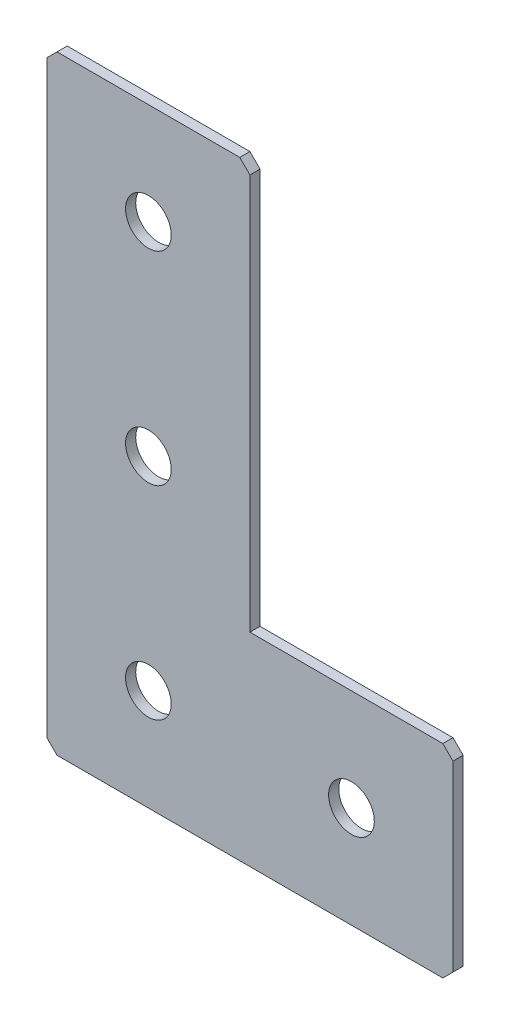
ISO-10303-21;
HEADER;
FILE_DESCRIPTION(('STEP AP214'),'2;1');
FILE_NAME('part.step','',(''),(''),'','','');
FILE_SCHEMA(('AUTOMOTIVE_DESIGN { 1 0 10303 214 1 1 1 1 }'));
ENDSEC;
DATA;
#1=APPLICATION_CONTEXT('core data for automotive mechanical design processes');
#2=APPLICATION_PROTOCOL_DEFINITION('international standard','automotive_design',2000,#1);
#3=PRODUCT_CONTEXT('',#1,'mechanical');
#4=PRODUCT('Part','Part','',(#3));
#5=PRODUCT_RELATED_PRODUCT_CATEGORY('part','',(#4));
#6=PRODUCT_DEFINITION_FORMATION('','',#4);
#7=PRODUCT_DEFINITION_CONTEXT('part definition',#1,'design');
#8=PRODUCT_DEFINITION('design','',#6,#7);
#9=PRODUCT_DEFINITION_SHAPE('','',#8);
#10=(LENGTH_UNIT() NAMED_UNIT(*) SI_UNIT(.MILLI.,.METRE.));
#11=(NAMED_UNIT(*) PLANE_ANGLE_UNIT() SI_UNIT($,.RADIAN.));
#12=(NAMED_UNIT(*) SI_UNIT($,.STERADIAN.) SOLID_ANGLE_UNIT());
#13=UNCERTAINTY_MEASURE_WITH_UNIT(LENGTH_MEASURE(1.E-05),#10,'distance_accuracy_value','');
#14=(GEOMETRIC_REPRESENTATION_CONTEXT(3) GLOBAL_UNCERTAINTY_ASSIGNED_CONTEXT((#13)) GLOBAL_UNIT_ASSIGNED_CONTEXT((#10,
#11,#12)) REPRESENTATION_CONTEXT('',''));
#15=CARTESIAN_POINT('',(0.,0.,0.));
#16=DIRECTION('',(0.,0.,1.));
#17=DIRECTION('',(1.,0.,0.));
#18=AXIS2_PLACEMENT_3D('',#15,#16,#17);
#19=CARTESIAN_POINT('',(40.,0.,-2.));
#20=DIRECTION('',(0.,-1.,0.));
#21=DIRECTION('',(1.,0.,0.));
#22=AXIS2_PLACEMENT_3D('',#19,#20,#21);
#23=PLANE('',#22);
#24=DIRECTION('',(1.,0.,0.));
#25=VECTOR('',#24,1.);
#26=CARTESIAN_POINT('',(40.,0.,-2.));
#27=LINE('',#26,#25);
#28=CARTESIAN_POINT('',(2.00000000000003,0.,-2.));
#29=VERTEX_POINT('',#28);
#30=CARTESIAN_POINT('',(38.,0.,-2.));
#31=VERTEX_POINT('',#30);
#32=EDGE_CURVE('E143',#29,#31,#27,.T.);
#33=ORIENTED_EDGE('',*,*,#32,.F.);
#34=DIRECTION('',(0.,0.,1.));
#35=VECTOR('',#34,1.);
#36=CARTESIAN_POINT('',(2.00000000000003,0.,-2.));
#37=LINE('',#36,#35);
#38=CARTESIAN_POINT('',(2.00000000000003,0.,0.));
#39=VERTEX_POINT('',#38);
#40=EDGE_CURVE('E197',#29,#39,#37,.T.);
#41=ORIENTED_EDGE('',*,*,#40,.T.);
#42=DIRECTION('',(1.,0.,0.));
#43=VECTOR('',#42,1.);
#44=CARTESIAN_POINT('',(40.,0.,0.));
#45=LINE('',#44,#43);
#46=CARTESIAN_POINT('',(38.,0.,0.));
#47=VERTEX_POINT('',#46);
#48=EDGE_CURVE('E174',#39,#47,#45,.T.);
#49=ORIENTED_EDGE('',*,*,#48,.T.);
#50=DIRECTION('',(0.,0.,-1.));
#51=VECTOR('',#50,1.);
#52=CARTESIAN_POINT('',(38.,0.,-2.));
#53=LINE('',#52,#51);
#54=EDGE_CURVE('E154',#47,#31,#53,.T.);
#55=ORIENTED_EDGE('',*,*,#54,.T.);
#56=EDGE_LOOP('',(#33,#41,#49,#55));
#57=FACE_BOUND('',#56,.T.);
#58=ADVANCED_FACE('F45',(#57),#23,.F.);
#59=CARTESIAN_POINT('',(40.,-80.,-2.));
#60=DIRECTION('',(-1.,0.,0.));
#61=DIRECTION('',(0.,-1.,0.));
#62=AXIS2_PLACEMENT_3D('',#59,#60,#61);
#63=PLANE('',#62);
#64=DIRECTION('',(0.,-1.,0.));
#65=VECTOR('',#64,1.);
#66=CARTESIAN_POINT('',(40.,-80.,-2.));
#67=LINE('',#66,#65);
#68=CARTESIAN_POINT('',(40.,-2.,-2.));
#69=VERTEX_POINT('',#68);
#70=CARTESIAN_POINT('',(40.,-80.,-2.));
#71=VERTEX_POINT('',#70);
#72=EDGE_CURVE('E129',#69,#71,#67,.T.);
#73=ORIENTED_EDGE('',*,*,#72,.F.);
#74=DIRECTION('',(0.,0.,1.));
#75=VECTOR('',#74,1.);
#76=CARTESIAN_POINT('',(40.,-2.,-2.));
#77=LINE('',#76,#75);
#78=CARTESIAN_POINT('',(40.,-2.,0.));
#79=VERTEX_POINT('',#78);
#80=EDGE_CURVE('E236',#69,#79,#77,.T.);
#81=ORIENTED_EDGE('',*,*,#80,.T.);
#82=DIRECTION('',(0.,-1.,0.));
#83=VECTOR('',#82,1.);
#84=CARTESIAN_POINT('',(40.,-80.,0.));
#85=LINE('',#84,#83);
#86=CARTESIAN_POINT('',(40.,-80.,0.));
#87=VERTEX_POINT('',#86);
#88=EDGE_CURVE('E149',#79,#87,#85,.T.);
#89=ORIENTED_EDGE('',*,*,#88,.T.);
#90=DIRECTION('',(0.,0.,1.));
#91=VECTOR('',#90,1.);
#92=CARTESIAN_POINT('',(40.,-80.,-2.));
#93=LINE('',#92,#91);
#94=EDGE_CURVE('E146',#71,#87,#93,.T.);
#95=ORIENTED_EDGE('',*,*,#94,.F.);
#96=EDGE_LOOP('',(#73,#81,#89,#95));
#97=FACE_BOUND('',#96,.T.);
#98=ADVANCED_FACE('F147',(#97),#63,.F.);
#99=CARTESIAN_POINT('',(80.,-80.,-2.));
#100=DIRECTION('',(0.,-1.,0.));
#101=DIRECTION('',(0.,0.,-1.));
#102=AXIS2_PLACEMENT_3D('',#99,#100,#101);
#103=PLANE('',#102);
#104=DIRECTION('',(1.,0.,0.));
#105=VECTOR('',#104,1.);
#106=CARTESIAN_POINT('',(80.,-80.,0.));
#107=LINE('',#106,#105);
#108=CARTESIAN_POINT('',(78.,-80.,0.));
#109=VERTEX_POINT('',#108);
#110=EDGE_CURVE('E181',#87,#109,#107,.T.);
#111=ORIENTED_EDGE('',*,*,#110,.T.);
#112=DIRECTION('',(0.,0.,-1.));
#113=VECTOR('',#112,1.);
#114=CARTESIAN_POINT('',(78.,-80.,-2.));
#115=LINE('',#114,#113);
#116=CARTESIAN_POINT('',(78.,-80.,-2.));
#117=VERTEX_POINT('',#116);
#118=EDGE_CURVE('E159',#109,#117,#115,.T.);
#119=ORIENTED_EDGE('',*,*,#118,.T.);
#120=DIRECTION('',(1.,0.,0.));
#121=VECTOR('',#120,1.);
#122=CARTESIAN_POINT('',(80.,-80.,-2.));
#123=LINE('',#122,#121);
#124=EDGE_CURVE('E134',#71,#117,#123,.T.);
#125=ORIENTED_EDGE('',*,*,#124,.F.);
#126=ORIENTED_EDGE('',*,*,#94,.T.);
#127=EDGE_LOOP('',(#111,#119,#125,#126));
#128=FACE_BOUND('',#127,.T.);
#129=ADVANCED_FACE('F157',(#128),#103,.F.);
#130=CARTESIAN_POINT('',(80.,-120.,-2.));
#131=DIRECTION('',(-1.,0.,0.));
#132=DIRECTION('',(0.,0.,1.));
#133=AXIS2_PLACEMENT_3D('',#130,#131,#132);
#134=PLANE('',#133);
#135=DIRECTION('',(0.,-1.,0.));
#136=VECTOR('',#135,1.);
#137=CARTESIAN_POINT('',(80.,-120.,-2.));
#138=LINE('',#137,#136);
#139=CARTESIAN_POINT('',(80.,-82.,-2.));
#140=VERTEX_POINT('',#139);
#141=CARTESIAN_POINT('',(80.,-118.,-2.));
#142=VERTEX_POINT('',#141);
#143=EDGE_CURVE('E161',#140,#142,#138,.T.);
#144=ORIENTED_EDGE('',*,*,#143,.F.);
#145=DIRECTION('',(0.,0.,1.));
#146=VECTOR('',#145,1.);
#147=CARTESIAN_POINT('',(80.,-82.,-2.));
#148=LINE('',#147,#146);
#149=CARTESIAN_POINT('',(80.,-82.,0.));
#150=VERTEX_POINT('',#149);
#151=EDGE_CURVE('E242',#140,#150,#148,.T.);
#152=ORIENTED_EDGE('',*,*,#151,.T.);
#153=DIRECTION('',(0.,-1.,0.));
#154=VECTOR('',#153,1.);
#155=CARTESIAN_POINT('',(80.,-120.,0.));
#156=LINE('',#155,#154);
#157=CARTESIAN_POINT('',(80.,-118.,0.));
#158=VERTEX_POINT('',#157);
#159=EDGE_CURVE('E184',#150,#158,#156,.T.);
#160=ORIENTED_EDGE('',*,*,#159,.T.);
#161=DIRECTION('',(0.,0.,-1.));
#162=VECTOR('',#161,1.);
#163=CARTESIAN_POINT('',(80.,-118.,-2.));
#164=LINE('',#163,#162);
#165=EDGE_CURVE('E239',#158,#142,#164,.T.);
#166=ORIENTED_EDGE('',*,*,#165,.T.);
#167=EDGE_LOOP('',(#144,#152,#160,#166));
#168=FACE_BOUND('',#167,.T.);
#169=ADVANCED_FACE('F366',(#168),#134,.F.);
#170=CARTESIAN_POINT('',(0.,-120.,-2.));
#171=DIRECTION('',(0.,1.,0.));
#172=DIRECTION('',(0.,0.,1.));
#173=AXIS2_PLACEMENT_3D('',#170,#171,#172);
#174=PLANE('',#173);
#175=DIRECTION('',(-1.,0.,0.));
#176=VECTOR('',#175,1.);
#177=CARTESIAN_POINT('',(0.,-120.,-2.));
#178=LINE('',#177,#176);
#179=CARTESIAN_POINT('',(78.,-120.,-2.));
#180=VERTEX_POINT('',#179);
#181=CARTESIAN_POINT('',(2.,-120.,-2.));
#182=VERTEX_POINT('',#181);
#183=EDGE_CURVE('E166',#180,#182,#178,.T.);
#184=ORIENTED_EDGE('',*,*,#183,.F.);
#185=DIRECTION('',(0.,0.,1.));
#186=VECTOR('',#185,1.);
#187=CARTESIAN_POINT('',(78.,-120.,-2.));
#188=LINE('',#187,#186);
#189=CARTESIAN_POINT('',(78.,-120.,0.));
#190=VERTEX_POINT('',#189);
#191=EDGE_CURVE('E11',#180,#190,#188,.T.);
#192=ORIENTED_EDGE('',*,*,#191,.T.);
#193=DIRECTION('',(-1.,0.,0.));
#194=VECTOR('',#193,1.);
#195=CARTESIAN_POINT('',(0.,-120.,0.));
#196=LINE('',#195,#194);
#197=CARTESIAN_POINT('',(2.,-120.,0.));
#198=VERTEX_POINT('',#197);
#199=EDGE_CURVE('E188',#190,#198,#196,.T.);
#200=ORIENTED_EDGE('',*,*,#199,.T.);
#201=DIRECTION('',(0.,0.,-1.));
#202=VECTOR('',#201,1.);
#203=CARTESIAN_POINT('',(2.,-120.,-2.));
#204=LINE('',#203,#202);
#205=EDGE_CURVE('E54',#198,#182,#204,.T.);
#206=ORIENTED_EDGE('',*,*,#205,.T.);
#207=EDGE_LOOP('',(#184,#192,#200,#206));
#208=FACE_BOUND('',#207,.T.);
#209=ADVANCED_FACE('F372',(#208),#174,.F.);
#210=CARTESIAN_POINT('',(0.,0.,-2.));
#211=DIRECTION('',(1.,0.,0.));
#212=DIRECTION('',(0.,0.,-1.));
#213=AXIS2_PLACEMENT_3D('',#210,#211,#212);
#214=PLANE('',#213);
#215=DIRECTION('',(0.,1.,0.));
#216=VECTOR('',#215,1.);
#217=CARTESIAN_POINT('',(0.,0.,0.));
#218=LINE('',#217,#216);
#219=CARTESIAN_POINT('',(0.,-118.,0.));
#220=VERTEX_POINT('',#219);
#221=CARTESIAN_POINT('',(0.,-2.00000000000004,0.));
#222=VERTEX_POINT('',#221);
#223=EDGE_CURVE('E191',#220,#222,#218,.T.);
#224=ORIENTED_EDGE('',*,*,#223,.T.);
#225=DIRECTION('',(0.,0.,-1.));
#226=VECTOR('',#225,1.);
#227=CARTESIAN_POINT('',(0.,-2.00000000000004,-2.));
#228=LINE('',#227,#226);
#229=CARTESIAN_POINT('',(0.,-2.00000000000004,-2.));
#230=VERTEX_POINT('',#229);
#231=EDGE_CURVE('E220',#222,#230,#228,.T.);
#232=ORIENTED_EDGE('',*,*,#231,.T.);
#233=DIRECTION('',(0.,1.,0.));
#234=VECTOR('',#233,1.);
#235=CARTESIAN_POINT('',(0.,0.,-2.));
#236=LINE('',#235,#234);
#237=CARTESIAN_POINT('',(0.,-118.,-2.));
#238=VERTEX_POINT('',#237);
#239=EDGE_CURVE('E155',#238,#230,#236,.T.);
#240=ORIENTED_EDGE('',*,*,#239,.F.);
#241=DIRECTION('',(0.,0.,1.));
#242=VECTOR('',#241,1.);
#243=CARTESIAN_POINT('',(0.,-118.,-2.));
#244=LINE('',#243,#242);
#245=EDGE_CURVE('E216',#238,#220,#244,.T.);
#246=ORIENTED_EDGE('',*,*,#245,.T.);
#247=EDGE_LOOP('',(#224,#232,#240,#246));
#248=FACE_BOUND('',#247,.T.);
#249=ADVANCED_FACE('F379',(#248),#214,.F.);
#250=CARTESIAN_POINT('',(0.,0.,-2.));
#251=DIRECTION('',(0.,0.,1.));
#252=DIRECTION('',(1.,0.,0.));
#253=AXIS2_PLACEMENT_3D('',#250,#251,#252);
#254=PLANE('',#253);
#255=CARTESIAN_POINT('',(60.,-100.,-2.00000000000001));
#256=DIRECTION('',(0.,0.,-1.));
#257=DIRECTION('',(0.,1.,0.));
#258=AXIS2_PLACEMENT_3D('',#255,#256,#257);
#259=CIRCLE('',#258,4.5);
#260=CARTESIAN_POINT('',(60.,-95.5,-2.00000000000001));
#261=VERTEX_POINT('',#260);
#262=EDGE_CURVE('E316',#261,#261,#259,.T.);
#263=ORIENTED_EDGE('',*,*,#262,.F.);
#264=EDGE_LOOP('',(#263));
#265=FACE_BOUND('',#264,.T.);
#266=CARTESIAN_POINT('',(20.,-100.,-2.00000000000001));
#267=DIRECTION('',(0.,0.,-1.));
#268=DIRECTION('',(0.,1.,0.));
#269=AXIS2_PLACEMENT_3D('',#266,#267,#268);
#270=CIRCLE('',#269,4.5);
#271=CARTESIAN_POINT('',(20.,-95.5,-2.00000000000001));
#272=VERTEX_POINT('',#271);
#273=EDGE_CURVE('E315',#272,#272,#270,.T.);
#274=ORIENTED_EDGE('',*,*,#273,.F.);
#275=EDGE_LOOP('',(#274));
#276=FACE_BOUND('',#275,.T.);
#277=CARTESIAN_POINT('',(20.,-60.,-2.));
#278=DIRECTION('',(0.,0.,-1.));
#279=DIRECTION('',(0.,1.,0.));
#280=AXIS2_PLACEMENT_3D('',#277,#278,#279);
#281=CIRCLE('',#280,4.5);
#282=CARTESIAN_POINT('',(20.,-55.5,-2.));
#283=VERTEX_POINT('',#282);
#284=EDGE_CURVE('E333',#283,#283,#281,.T.);
#285=ORIENTED_EDGE('',*,*,#284,.F.);
#286=EDGE_LOOP('',(#285));
#287=FACE_BOUND('',#286,.T.);
#288=CARTESIAN_POINT('',(20.,-20.,-2.));
#289=DIRECTION('',(0.,0.,-1.));
#290=DIRECTION('',(0.,1.,0.));
#291=AXIS2_PLACEMENT_3D('',#288,#289,#290);
#292=CIRCLE('',#291,4.5);
#293=CARTESIAN_POINT('',(20.,-15.5,-2.));
#294=VERTEX_POINT('',#293);
#295=EDGE_CURVE('E343',#294,#294,#292,.T.);
#296=ORIENTED_EDGE('',*,*,#295,.F.);
#297=EDGE_LOOP('',(#296));
#298=FACE_BOUND('',#297,.T.);
#299=ORIENTED_EDGE('',*,*,#239,.T.);
#300=DIRECTION('',(-0.707106781186545,-0.70710678118655,0.));
#301=VECTOR('',#300,1.);
#302=CARTESIAN_POINT('',(2.00000000000003,0.,-2.));
#303=LINE('',#302,#301);
#304=EDGE_CURVE('E233',#230,#29,#303,.F.);
#305=ORIENTED_EDGE('',*,*,#304,.T.);
#306=ORIENTED_EDGE('',*,*,#32,.T.);
#307=DIRECTION('',(-0.70710678118655,0.707106781186545,0.));
#308=VECTOR('',#307,1.);
#309=CARTESIAN_POINT('',(40.,-2.,-2.));
#310=LINE('',#309,#308);
#311=EDGE_CURVE('E138',#31,#69,#310,.F.);
#312=ORIENTED_EDGE('',*,*,#311,.T.);
#313=ORIENTED_EDGE('',*,*,#72,.T.);
#314=ORIENTED_EDGE('',*,*,#124,.T.);
#315=DIRECTION('',(-0.707106781186548,0.707106781186548,0.));
#316=VECTOR('',#315,1.);
#317=CARTESIAN_POINT('',(80.,-82.,-2.));
#318=LINE('',#317,#316);
#319=EDGE_CURVE('E228',#117,#140,#318,.F.);
#320=ORIENTED_EDGE('',*,*,#319,.T.);
#321=ORIENTED_EDGE('',*,*,#143,.T.);
#322=DIRECTION('',(0.707106781186548,0.707106781186548,0.));
#323=VECTOR('',#322,1.);
#324=CARTESIAN_POINT('',(78.,-120.,-2.));
#325=LINE('',#324,#323);
#326=EDGE_CURVE('E67',#142,#180,#325,.F.);
#327=ORIENTED_EDGE('',*,*,#326,.T.);
#328=ORIENTED_EDGE('',*,*,#183,.T.);
#329=DIRECTION('',(0.70710678118655,-0.707106781186545,0.));
#330=VECTOR('',#329,1.);
#331=CARTESIAN_POINT('',(0.,-118.,-2.));
#332=LINE('',#331,#330);
#333=EDGE_CURVE('E223',#182,#238,#332,.F.);
#334=ORIENTED_EDGE('',*,*,#333,.T.);
#335=EDGE_LOOP('',(#299,#305,#306,#312,#313,#314,#320,#321,#327,#328,#334));
#336=FACE_BOUND('',#335,.T.);
#337=ADVANCED_FACE('F132',(#265,#276,#287,#298,#336),#254,.F.);
#338=CARTESIAN_POINT('',(0.,0.,0.));
#339=DIRECTION('',(0.,0.,1.));
#340=DIRECTION('',(1.,0.,0.));
#341=AXIS2_PLACEMENT_3D('',#338,#339,#340);
#342=PLANE('',#341);
#343=CARTESIAN_POINT('',(60.,-100.,0.));
#344=DIRECTION('',(0.,0.,-1.));
#345=DIRECTION('',(0.,1.,0.));
#346=AXIS2_PLACEMENT_3D('',#343,#344,#345);
#347=CIRCLE('',#346,4.5);
#348=CARTESIAN_POINT('',(60.,-95.5,0.));
#349=VERTEX_POINT('',#348);
#350=EDGE_CURVE('E312',#349,#349,#347,.T.);
#351=ORIENTED_EDGE('',*,*,#350,.T.);
#352=EDGE_LOOP('',(#351));
#353=FACE_BOUND('',#352,.T.);
#354=CARTESIAN_POINT('',(20.,-100.,0.));
#355=DIRECTION('',(0.,0.,-1.));
#356=DIRECTION('',(0.,1.,0.));
#357=AXIS2_PLACEMENT_3D('',#354,#355,#356);
#358=CIRCLE('',#357,4.5);
#359=CARTESIAN_POINT('',(20.,-95.5,0.));
#360=VERTEX_POINT('',#359);
#361=EDGE_CURVE('E328',#360,#360,#358,.T.);
#362=ORIENTED_EDGE('',*,*,#361,.T.);
#363=EDGE_LOOP('',(#362));
#364=FACE_BOUND('',#363,.T.);
#365=CARTESIAN_POINT('',(20.,-60.,0.));
#366=DIRECTION('',(0.,0.,-1.));
#367=DIRECTION('',(0.,1.,0.));
#368=AXIS2_PLACEMENT_3D('',#365,#366,#367);
#369=CIRCLE('',#368,4.5);
#370=CARTESIAN_POINT('',(20.,-55.5,0.));
#371=VERTEX_POINT('',#370);
#372=EDGE_CURVE('E339',#371,#371,#369,.T.);
#373=ORIENTED_EDGE('',*,*,#372,.T.);
#374=EDGE_LOOP('',(#373));
#375=FACE_BOUND('',#374,.T.);
#376=CARTESIAN_POINT('',(20.,-20.,0.));
#377=DIRECTION('',(0.,0.,-1.));
#378=DIRECTION('',(0.,1.,0.));
#379=AXIS2_PLACEMENT_3D('',#376,#377,#378);
#380=CIRCLE('',#379,4.5);
#381=CARTESIAN_POINT('',(20.,-15.5,0.));
#382=VERTEX_POINT('',#381);
#383=EDGE_CURVE('E178',#382,#382,#380,.T.);
#384=ORIENTED_EDGE('',*,*,#383,.T.);
#385=EDGE_LOOP('',(#384));
#386=FACE_BOUND('',#385,.T.);
#387=ORIENTED_EDGE('',*,*,#48,.F.);
#388=DIRECTION('',(0.707106781186545,0.70710678118655,0.));
#389=VECTOR('',#388,1.);
#390=CARTESIAN_POINT('',(1.00000000000002,-1.00000000000001,0.));
#391=LINE('',#390,#389);
#392=EDGE_CURVE('E213',#39,#222,#391,.F.);
#393=ORIENTED_EDGE('',*,*,#392,.T.);
#394=ORIENTED_EDGE('',*,*,#223,.F.);
#395=DIRECTION('',(-0.70710678118655,0.707106781186545,0.));
#396=VECTOR('',#395,1.);
#397=CARTESIAN_POINT('',(-59.,-59.0000000000004,0.));
#398=LINE('',#397,#396);
#399=EDGE_CURVE('E201',#220,#198,#398,.F.);
#400=ORIENTED_EDGE('',*,*,#399,.T.);
#401=ORIENTED_EDGE('',*,*,#199,.F.);
#402=DIRECTION('',(-0.707106781186548,-0.707106781186548,0.));
#403=VECTOR('',#402,1.);
#404=CARTESIAN_POINT('',(99.,-99.,0.));
#405=LINE('',#404,#403);
#406=EDGE_CURVE('E204',#190,#158,#405,.F.);
#407=ORIENTED_EDGE('',*,*,#406,.T.);
#408=ORIENTED_EDGE('',*,*,#159,.F.);
#409=DIRECTION('',(0.707106781186548,-0.707106781186548,0.));
#410=VECTOR('',#409,1.);
#411=CARTESIAN_POINT('',(-1.00000000000001,-1.00000000000001,0.));
#412=LINE('',#411,#410);
#413=EDGE_CURVE('E207',#150,#109,#412,.F.);
#414=ORIENTED_EDGE('',*,*,#413,.T.);
#415=ORIENTED_EDGE('',*,*,#110,.F.);
#416=ORIENTED_EDGE('',*,*,#88,.F.);
#417=DIRECTION('',(0.70710678118655,-0.707106781186545,0.));
#418=VECTOR('',#417,1.);
#419=CARTESIAN_POINT('',(18.9999999999998,19.,0.));
#420=LINE('',#419,#418);
#421=EDGE_CURVE('E210',#79,#47,#420,.F.);
#422=ORIENTED_EDGE('',*,*,#421,.T.);
#423=EDGE_LOOP('',(#387,#393,#394,#400,#401,#407,#408,#414,#415,#416,#422));
#424=FACE_BOUND('',#423,.T.);
#425=ADVANCED_FACE('F359',(#353,#364,#375,#386,#424),#342,.T.);
#426=CARTESIAN_POINT('',(20.,-20.,-2.));
#427=DIRECTION('',(0.,0.,-1.));
#428=DIRECTION('',(0.,1.,0.));
#429=AXIS2_PLACEMENT_3D('',#426,#427,#428);
#430=CYLINDRICAL_SURFACE('',#429,4.5);
#431=ORIENTED_EDGE('',*,*,#383,.F.);
#432=EDGE_LOOP('',(#431));
#433=FACE_BOUND('',#432,.T.);
#434=ORIENTED_EDGE('',*,*,#295,.T.);
#435=EDGE_LOOP('',(#434));
#436=FACE_BOUND('',#435,.T.);
#437=ADVANCED_FACE('F447',(#433,#436),#430,.F.);
#438=CARTESIAN_POINT('',(20.,-60.,-2.));
#439=DIRECTION('',(0.,0.,-1.));
#440=DIRECTION('',(0.,1.,0.));
#441=AXIS2_PLACEMENT_3D('',#438,#439,#440);
#442=CYLINDRICAL_SURFACE('',#441,4.5);
#443=ORIENTED_EDGE('',*,*,#372,.F.);
#444=EDGE_LOOP('',(#443));
#445=FACE_BOUND('',#444,.T.);
#446=ORIENTED_EDGE('',*,*,#284,.T.);
#447=EDGE_LOOP('',(#446));
#448=FACE_BOUND('',#447,.T.);
#449=ADVANCED_FACE('F438',(#445,#448),#442,.F.);
#450=CARTESIAN_POINT('',(20.,-100.,-2.00000000000001));
#451=DIRECTION('',(0.,0.,-1.));
#452=DIRECTION('',(0.,1.,0.));
#453=AXIS2_PLACEMENT_3D('',#450,#451,#452);
#454=CYLINDRICAL_SURFACE('',#453,4.5);
#455=ORIENTED_EDGE('',*,*,#361,.F.);
#456=EDGE_LOOP('',(#455));
#457=FACE_BOUND('',#456,.T.);
#458=ORIENTED_EDGE('',*,*,#273,.T.);
#459=EDGE_LOOP('',(#458));
#460=FACE_BOUND('',#459,.T.);
#461=ADVANCED_FACE('F429',(#457,#460),#454,.F.);
#462=CARTESIAN_POINT('',(60.,-100.,-2.00000000000001));
#463=DIRECTION('',(0.,0.,-1.));
#464=DIRECTION('',(0.,1.,0.));
#465=AXIS2_PLACEMENT_3D('',#462,#463,#464);
#466=CYLINDRICAL_SURFACE('',#465,4.5);
#467=ORIENTED_EDGE('',*,*,#350,.F.);
#468=EDGE_LOOP('',(#467));
#469=FACE_BOUND('',#468,.T.);
#470=ORIENTED_EDGE('',*,*,#262,.T.);
#471=EDGE_LOOP('',(#470));
#472=FACE_BOUND('',#471,.T.);
#473=ADVANCED_FACE('F393',(#469,#472),#466,.F.);
#474=CARTESIAN_POINT('',(2.00000000000003,0.,-2.));
#475=DIRECTION('',(0.70710678118655,-0.707106781186545,0.));
#476=DIRECTION('',(0.,0.,1.));
#477=AXIS2_PLACEMENT_3D('',#474,#475,#476);
#478=PLANE('',#477);
#479=ORIENTED_EDGE('',*,*,#304,.F.);
#480=ORIENTED_EDGE('',*,*,#231,.F.);
#481=ORIENTED_EDGE('',*,*,#392,.F.);
#482=ORIENTED_EDGE('',*,*,#40,.F.);
#483=EDGE_LOOP('',(#479,#480,#481,#482));
#484=FACE_BOUND('',#483,.T.);
#485=ADVANCED_FACE('F382',(#484),#478,.F.);
#486=CARTESIAN_POINT('',(40.,-2.,-2.));
#487=DIRECTION('',(-0.707106781186545,-0.70710678118655,0.));
#488=DIRECTION('',(0.,0.,1.));
#489=AXIS2_PLACEMENT_3D('',#486,#487,#488);
#490=PLANE('',#489);
#491=ORIENTED_EDGE('',*,*,#311,.F.);
#492=ORIENTED_EDGE('',*,*,#54,.F.);
#493=ORIENTED_EDGE('',*,*,#421,.F.);
#494=ORIENTED_EDGE('',*,*,#80,.F.);
#495=EDGE_LOOP('',(#491,#492,#493,#494));
#496=FACE_BOUND('',#495,.T.);
#497=ADVANCED_FACE('F356',(#496),#490,.F.);
#498=CARTESIAN_POINT('',(80.,-82.,-2.));
#499=DIRECTION('',(-0.707106781186547,-0.707106781186547,0.));
#500=DIRECTION('',(0.,0.,1.));
#501=AXIS2_PLACEMENT_3D('',#498,#499,#500);
#502=PLANE('',#501);
#503=ORIENTED_EDGE('',*,*,#319,.F.);
#504=ORIENTED_EDGE('',*,*,#118,.F.);
#505=ORIENTED_EDGE('',*,*,#413,.F.);
#506=ORIENTED_EDGE('',*,*,#151,.F.);
#507=EDGE_LOOP('',(#503,#504,#505,#506));
#508=FACE_BOUND('',#507,.T.);
#509=ADVANCED_FACE('F362',(#508),#502,.F.);
#510=CARTESIAN_POINT('',(78.,-120.,-2.));
#511=DIRECTION('',(-0.707106781186547,0.707106781186547,0.));
#512=DIRECTION('',(0.,0.,1.));
#513=AXIS2_PLACEMENT_3D('',#510,#511,#512);
#514=PLANE('',#513);
#515=ORIENTED_EDGE('',*,*,#326,.F.);
#516=ORIENTED_EDGE('',*,*,#165,.F.);
#517=ORIENTED_EDGE('',*,*,#406,.F.);
#518=ORIENTED_EDGE('',*,*,#191,.F.);
#519=EDGE_LOOP('',(#515,#516,#517,#518));
#520=FACE_BOUND('',#519,.T.);
#521=ADVANCED_FACE('F369',(#520),#514,.F.);
#522=CARTESIAN_POINT('',(0.,-118.,-2.));
#523=DIRECTION('',(0.707106781186545,0.70710678118655,0.));
#524=DIRECTION('',(0.,0.,1.));
#525=AXIS2_PLACEMENT_3D('',#522,#523,#524);
#526=PLANE('',#525);
#527=ORIENTED_EDGE('',*,*,#333,.F.);
#528=ORIENTED_EDGE('',*,*,#205,.F.);
#529=ORIENTED_EDGE('',*,*,#399,.F.);
#530=ORIENTED_EDGE('',*,*,#245,.F.);
#531=EDGE_LOOP('',(#527,#528,#529,#530));
#532=FACE_BOUND('',#531,.T.);
#533=ADVANCED_FACE('F47',(#532),#526,.F.);
#534=CLOSED_SHELL('',(#58,#98,#129,#169,#209,#249,#337,#425,#437,#449,#461,#473,#485,#497,#509,
#521,#533));
#535=MANIFOLD_SOLID_BREP('B2',#534);
#536=ADVANCED_BREP_SHAPE_REPRESENTATION('',(#18,#535),#14);
#537=SHAPE_DEFINITION_REPRESENTATION(#9,#536);
ENDSEC;
END-ISO-10303-21;
